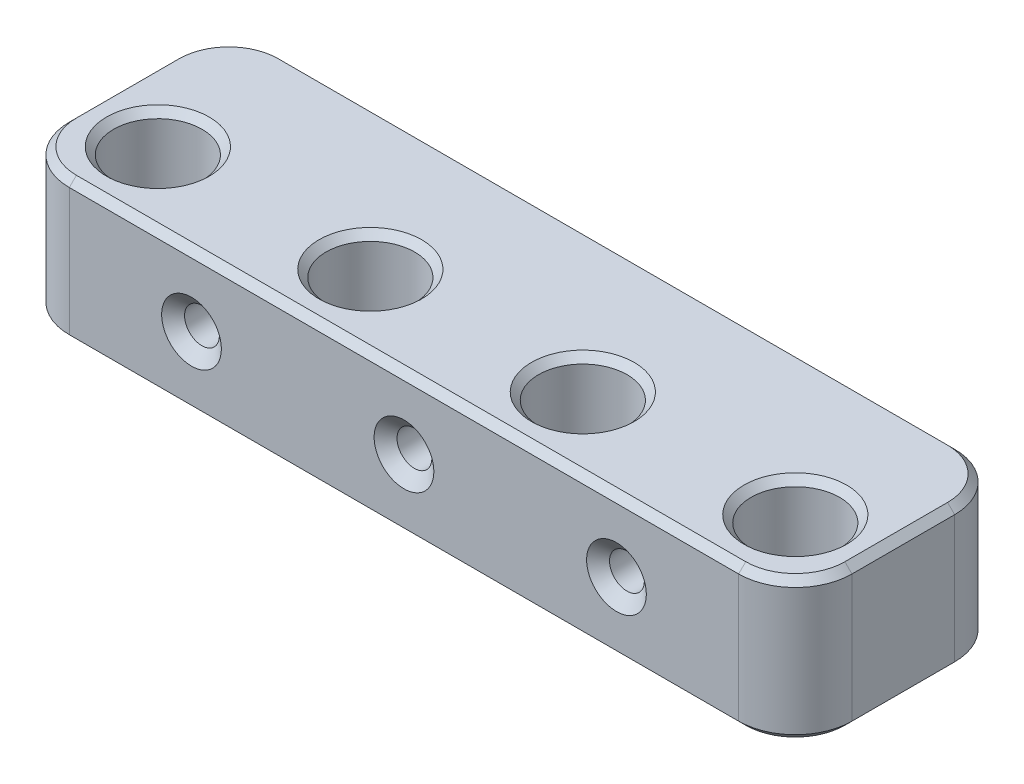
ISO-10303-21;
HEADER;
FILE_DESCRIPTION(('STEP AP214'),'2;1');
FILE_NAME('part.step','',(''),(''),'','','');
FILE_SCHEMA(('AUTOMOTIVE_DESIGN { 1 0 10303 214 1 1 1 1 }'));
ENDSEC;
DATA;
#1=APPLICATION_CONTEXT('core data for automotive mechanical design processes');
#2=APPLICATION_PROTOCOL_DEFINITION('international standard','automotive_design',2000,#1);
#3=PRODUCT_CONTEXT('',#1,'mechanical');
#4=PRODUCT('Part','Part','',(#3));
#5=PRODUCT_RELATED_PRODUCT_CATEGORY('part','',(#4));
#6=PRODUCT_DEFINITION_FORMATION('','',#4);
#7=PRODUCT_DEFINITION_CONTEXT('part definition',#1,'design');
#8=PRODUCT_DEFINITION('design','',#6,#7);
#9=PRODUCT_DEFINITION_SHAPE('','',#8);
#10=(LENGTH_UNIT() NAMED_UNIT(*) SI_UNIT(.MILLI.,.METRE.));
#11=(NAMED_UNIT(*) PLANE_ANGLE_UNIT() SI_UNIT($,.RADIAN.));
#12=(NAMED_UNIT(*) SI_UNIT($,.STERADIAN.) SOLID_ANGLE_UNIT());
#13=UNCERTAINTY_MEASURE_WITH_UNIT(LENGTH_MEASURE(1.E-05),#10,'distance_accuracy_value','');
#14=(GEOMETRIC_REPRESENTATION_CONTEXT(3) GLOBAL_UNCERTAINTY_ASSIGNED_CONTEXT((#13)) GLOBAL_UNIT_ASSIGNED_CONTEXT((#10,
#11,#12)) REPRESENTATION_CONTEXT('',''));
#15=CARTESIAN_POINT('',(0.,0.,0.));
#16=DIRECTION('',(0.,0.,1.));
#17=DIRECTION('',(1.,0.,0.));
#18=AXIS2_PLACEMENT_3D('',#15,#16,#17);
#19=CARTESIAN_POINT('',(-10.25,20.,10.25));
#20=DIRECTION('',(0.,0.,-1.));
#21=DIRECTION('',(-1.,0.,0.));
#22=AXIS2_PLACEMENT_3D('',#19,#20,#21);
#23=PLANE('',#22);
#24=CARTESIAN_POINT('',(15.,10.,10.25));
#25=DIRECTION('',(0.,0.,1.));
#26=DIRECTION('',(1.,0.,0.));
#27=AXIS2_PLACEMENT_3D('',#24,#25,#26);
#28=CIRCLE('',#27,4.2164);
#29=CARTESIAN_POINT('',(19.2164,10.,10.25));
#30=VERTEX_POINT('',#29);
#31=EDGE_CURVE('E292',#30,#30,#28,.T.);
#32=ORIENTED_EDGE('',*,*,#31,.F.);
#33=EDGE_LOOP('',(#32));
#34=FACE_BOUND('',#33,.T.);
#35=CARTESIAN_POINT('',(75.,10.,10.25));
#36=DIRECTION('',(0.,0.,1.));
#37=DIRECTION('',(1.,0.,0.));
#38=AXIS2_PLACEMENT_3D('',#35,#36,#37);
#39=CIRCLE('',#38,4.21639999999999);
#40=CARTESIAN_POINT('',(79.2164,10.,10.25));
#41=VERTEX_POINT('',#40);
#42=EDGE_CURVE('E415',#41,#41,#39,.T.);
#43=ORIENTED_EDGE('',*,*,#42,.F.);
#44=EDGE_LOOP('',(#43));
#45=FACE_BOUND('',#44,.T.);
#46=DIRECTION('',(0.,-1.,0.));
#47=VECTOR('',#46,1.);
#48=CARTESIAN_POINT('',(-2.25,20.,10.25));
#49=LINE('',#48,#47);
#50=CARTESIAN_POINT('',(-2.25,19.,10.25));
#51=VERTEX_POINT('',#50);
#52=CARTESIAN_POINT('',(-2.25,1.,10.25));
#53=VERTEX_POINT('',#52);
#54=EDGE_CURVE('E331',#51,#53,#49,.T.);
#55=ORIENTED_EDGE('',*,*,#54,.T.);
#56=DIRECTION('',(1.,0.,0.));
#57=VECTOR('',#56,1.);
#58=CARTESIAN_POINT('',(92.25,1.,10.25));
#59=LINE('',#58,#57);
#60=CARTESIAN_POINT('',(92.25,1.,10.25));
#61=VERTEX_POINT('',#60);
#62=EDGE_CURVE('E226',#53,#61,#59,.T.);
#63=ORIENTED_EDGE('',*,*,#62,.T.);
#64=DIRECTION('',(0.,-1.,0.));
#65=VECTOR('',#64,1.);
#66=CARTESIAN_POINT('',(92.25,20.,10.25));
#67=LINE('',#66,#65);
#68=CARTESIAN_POINT('',(92.25,19.,10.25));
#69=VERTEX_POINT('',#68);
#70=EDGE_CURVE('E174',#61,#69,#67,.F.);
#71=ORIENTED_EDGE('',*,*,#70,.T.);
#72=DIRECTION('',(-1.,0.,0.));
#73=VECTOR('',#72,1.);
#74=CARTESIAN_POINT('',(-10.25,19.,10.25));
#75=LINE('',#74,#73);
#76=EDGE_CURVE('E224',#69,#51,#75,.T.);
#77=ORIENTED_EDGE('',*,*,#76,.T.);
#78=EDGE_LOOP('',(#55,#63,#71,#77));
#79=FACE_BOUND('',#78,.T.);
#80=CARTESIAN_POINT('',(45.,10.,10.25));
#81=DIRECTION('',(0.,0.,1.));
#82=DIRECTION('',(1.,0.,0.));
#83=AXIS2_PLACEMENT_3D('',#80,#81,#82);
#84=CIRCLE('',#83,4.2164);
#85=CARTESIAN_POINT('',(49.2164,10.,10.25));
#86=VERTEX_POINT('',#85);
#87=EDGE_CURVE('E424',#86,#86,#84,.T.);
#88=ORIENTED_EDGE('',*,*,#87,.F.);
#89=EDGE_LOOP('',(#88));
#90=FACE_BOUND('',#89,.T.);
#91=ADVANCED_FACE('F38',(#34,#45,#79,#90),#23,.F.);
#92=CARTESIAN_POINT('',(0.,20.,0.));
#93=DIRECTION('',(0.,-1.,0.));
#94=DIRECTION('',(0.,0.,-1.));
#95=AXIS2_PLACEMENT_3D('',#92,#93,#94);
#96=PLANE('',#95);
#97=CARTESIAN_POINT('',(90.,20.,0.));
#98=DIRECTION('',(0.,-1.,0.));
#99=DIRECTION('',(0.,0.,-1.));
#100=AXIS2_PLACEMENT_3D('',#97,#98,#99);
#101=CIRCLE('',#100,7.25000000000002);
#102=CARTESIAN_POINT('',(90.,20.,-7.25000000000002));
#103=VERTEX_POINT('',#102);
#104=EDGE_CURVE('E11',#103,#103,#101,.T.);
#105=ORIENTED_EDGE('',*,*,#104,.T.);
#106=EDGE_LOOP('',(#105));
#107=FACE_BOUND('',#106,.T.);
#108=CARTESIAN_POINT('',(60.,20.,0.));
#109=DIRECTION('',(0.,-1.,0.));
#110=DIRECTION('',(0.,0.,-1.));
#111=AXIS2_PLACEMENT_3D('',#108,#109,#110);
#112=CIRCLE('',#111,7.25000000000002);
#113=CARTESIAN_POINT('',(60.,20.,-7.25000000000002));
#114=VERTEX_POINT('',#113);
#115=EDGE_CURVE('E48',#114,#114,#112,.T.);
#116=ORIENTED_EDGE('',*,*,#115,.T.);
#117=EDGE_LOOP('',(#116));
#118=FACE_BOUND('',#117,.T.);
#119=CARTESIAN_POINT('',(30.,20.,0.));
#120=DIRECTION('',(0.,-1.,0.));
#121=DIRECTION('',(0.,0.,-1.));
#122=AXIS2_PLACEMENT_3D('',#119,#120,#121);
#123=CIRCLE('',#122,7.25000000000002);
#124=CARTESIAN_POINT('',(30.,20.,-7.25000000000002));
#125=VERTEX_POINT('',#124);
#126=EDGE_CURVE('E270',#125,#125,#123,.T.);
#127=ORIENTED_EDGE('',*,*,#126,.T.);
#128=EDGE_LOOP('',(#127));
#129=FACE_BOUND('',#128,.T.);
#130=CARTESIAN_POINT('',(0.,20.,0.));
#131=DIRECTION('',(0.,-1.,0.));
#132=DIRECTION('',(0.,0.,-1.));
#133=AXIS2_PLACEMENT_3D('',#130,#131,#132);
#134=CIRCLE('',#133,7.25000000000002);
#135=CARTESIAN_POINT('',(0.,20.,-7.25000000000002));
#136=VERTEX_POINT('',#135);
#137=EDGE_CURVE('E267',#136,#136,#134,.T.);
#138=ORIENTED_EDGE('',*,*,#137,.T.);
#139=EDGE_LOOP('',(#138));
#140=FACE_BOUND('',#139,.T.);
#141=DIRECTION('',(0.,0.,-1.));
#142=VECTOR('',#141,1.);
#143=CARTESIAN_POINT('',(99.25,20.,0.));
#144=LINE('',#143,#142);
#145=CARTESIAN_POINT('',(99.25,20.,2.25));
#146=VERTEX_POINT('',#145);
#147=CARTESIAN_POINT('',(99.25,20.,-12.25));
#148=VERTEX_POINT('',#147);
#149=EDGE_CURVE('E56',#146,#148,#144,.T.);
#150=ORIENTED_EDGE('',*,*,#149,.T.);
#151=CARTESIAN_POINT('',(92.25,20.,-12.25));
#152=DIRECTION('',(0.,-1.,0.));
#153=DIRECTION('',(0.,0.,-1.));
#154=AXIS2_PLACEMENT_3D('',#151,#152,#153);
#155=CIRCLE('',#154,7.);
#156=CARTESIAN_POINT('',(92.25,20.,-19.25));
#157=VERTEX_POINT('',#156);
#158=EDGE_CURVE('E265',#148,#157,#155,.F.);
#159=ORIENTED_EDGE('',*,*,#158,.T.);
#160=DIRECTION('',(-1.,0.,0.));
#161=VECTOR('',#160,1.);
#162=CARTESIAN_POINT('',(-2.25,20.,-19.25));
#163=LINE('',#162,#161);
#164=CARTESIAN_POINT('',(-2.25,20.,-19.25));
#165=VERTEX_POINT('',#164);
#166=EDGE_CURVE('E253',#157,#165,#163,.T.);
#167=ORIENTED_EDGE('',*,*,#166,.T.);
#168=CARTESIAN_POINT('',(-2.25,20.,-12.25));
#169=DIRECTION('',(0.,-1.,0.));
#170=DIRECTION('',(0.,0.,-1.));
#171=AXIS2_PLACEMENT_3D('',#168,#169,#170);
#172=CIRCLE('',#171,7.);
#173=CARTESIAN_POINT('',(-9.25,20.,-12.25));
#174=VERTEX_POINT('',#173);
#175=EDGE_CURVE('E255',#165,#174,#172,.F.);
#176=ORIENTED_EDGE('',*,*,#175,.T.);
#177=DIRECTION('',(0.,0.,1.));
#178=VECTOR('',#177,1.);
#179=CARTESIAN_POINT('',(-9.25,20.,0.));
#180=LINE('',#179,#178);
#181=CARTESIAN_POINT('',(-9.25,20.,2.25));
#182=VERTEX_POINT('',#181);
#183=EDGE_CURVE('E257',#174,#182,#180,.T.);
#184=ORIENTED_EDGE('',*,*,#183,.T.);
#185=CARTESIAN_POINT('',(-2.25,20.,2.25));
#186=DIRECTION('',(0.,-1.,0.));
#187=DIRECTION('',(0.,0.,-1.));
#188=AXIS2_PLACEMENT_3D('',#185,#186,#187);
#189=CIRCLE('',#188,7.);
#190=CARTESIAN_POINT('',(-2.25,20.,9.25));
#191=VERTEX_POINT('',#190);
#192=EDGE_CURVE('E259',#182,#191,#189,.F.);
#193=ORIENTED_EDGE('',*,*,#192,.T.);
#194=DIRECTION('',(1.,0.,0.));
#195=VECTOR('',#194,1.);
#196=CARTESIAN_POINT('',(0.,20.,9.25));
#197=LINE('',#196,#195);
#198=CARTESIAN_POINT('',(92.25,20.,9.25));
#199=VERTEX_POINT('',#198);
#200=EDGE_CURVE('E261',#191,#199,#197,.T.);
#201=ORIENTED_EDGE('',*,*,#200,.T.);
#202=CARTESIAN_POINT('',(92.25,20.,2.25));
#203=DIRECTION('',(0.,-1.,0.));
#204=DIRECTION('',(0.,0.,-1.));
#205=AXIS2_PLACEMENT_3D('',#202,#203,#204);
#206=CIRCLE('',#205,6.99999999999999);
#207=EDGE_CURVE('E61',#199,#146,#206,.F.);
#208=ORIENTED_EDGE('',*,*,#207,.T.);
#209=EDGE_LOOP('',(#150,#159,#167,#176,#184,#193,#201,#208));
#210=FACE_BOUND('',#209,.T.);
#211=ADVANCED_FACE('F388',(#107,#118,#129,#140,#210),#96,.F.);
#212=CARTESIAN_POINT('',(0.,0.,0.));
#213=DIRECTION('',(0.,-1.,0.));
#214=DIRECTION('',(0.,0.,-1.));
#215=AXIS2_PLACEMENT_3D('',#212,#213,#214);
#216=PLANE('',#215);
#217=CARTESIAN_POINT('',(90.,0.,0.));
#218=DIRECTION('',(0.,-1.,0.));
#219=DIRECTION('',(0.,0.,-1.));
#220=AXIS2_PLACEMENT_3D('',#217,#218,#219);
#221=CIRCLE('',#220,7.25000000000002);
#222=CARTESIAN_POINT('',(90.,0.,-7.25000000000002));
#223=VERTEX_POINT('',#222);
#224=EDGE_CURVE('E194',#223,#223,#221,.F.);
#225=ORIENTED_EDGE('',*,*,#224,.T.);
#226=EDGE_LOOP('',(#225));
#227=FACE_BOUND('',#226,.T.);
#228=CARTESIAN_POINT('',(60.,0.,0.));
#229=DIRECTION('',(0.,-1.,0.));
#230=DIRECTION('',(0.,0.,-1.));
#231=AXIS2_PLACEMENT_3D('',#228,#229,#230);
#232=CIRCLE('',#231,7.25000000000002);
#233=CARTESIAN_POINT('',(60.,0.,-7.25000000000002));
#234=VERTEX_POINT('',#233);
#235=EDGE_CURVE('E191',#234,#234,#232,.F.);
#236=ORIENTED_EDGE('',*,*,#235,.T.);
#237=EDGE_LOOP('',(#236));
#238=FACE_BOUND('',#237,.T.);
#239=CARTESIAN_POINT('',(30.,0.,0.));
#240=DIRECTION('',(0.,-1.,0.));
#241=DIRECTION('',(0.,0.,-1.));
#242=AXIS2_PLACEMENT_3D('',#239,#240,#241);
#243=CIRCLE('',#242,7.25000000000002);
#244=CARTESIAN_POINT('',(30.,0.,-7.25000000000002));
#245=VERTEX_POINT('',#244);
#246=EDGE_CURVE('E183',#245,#245,#243,.F.);
#247=ORIENTED_EDGE('',*,*,#246,.T.);
#248=EDGE_LOOP('',(#247));
#249=FACE_BOUND('',#248,.T.);
#250=CARTESIAN_POINT('',(0.,0.,0.));
#251=DIRECTION('',(0.,-1.,0.));
#252=DIRECTION('',(0.,0.,-1.));
#253=AXIS2_PLACEMENT_3D('',#250,#251,#252);
#254=CIRCLE('',#253,7.25000000000002);
#255=CARTESIAN_POINT('',(0.,0.,-7.25000000000002));
#256=VERTEX_POINT('',#255);
#257=EDGE_CURVE('E180',#256,#256,#254,.F.);
#258=ORIENTED_EDGE('',*,*,#257,.T.);
#259=EDGE_LOOP('',(#258));
#260=FACE_BOUND('',#259,.T.);
#261=DIRECTION('',(-1.,0.,0.));
#262=VECTOR('',#261,1.);
#263=CARTESIAN_POINT('',(-2.25,0.,9.25));
#264=LINE('',#263,#262);
#265=CARTESIAN_POINT('',(92.25,0.,9.25000000000001));
#266=VERTEX_POINT('',#265);
#267=CARTESIAN_POINT('',(-2.25,0.,9.25));
#268=VERTEX_POINT('',#267);
#269=EDGE_CURVE('E178',#266,#268,#264,.T.);
#270=ORIENTED_EDGE('',*,*,#269,.T.);
#271=CARTESIAN_POINT('',(-2.25,0.,2.25));
#272=DIRECTION('',(0.,-1.,0.));
#273=DIRECTION('',(0.,0.,-1.));
#274=AXIS2_PLACEMENT_3D('',#271,#272,#273);
#275=CIRCLE('',#274,7.);
#276=CARTESIAN_POINT('',(-9.25,0.,2.25));
#277=VERTEX_POINT('',#276);
#278=EDGE_CURVE('E159',#268,#277,#275,.T.);
#279=ORIENTED_EDGE('',*,*,#278,.T.);
#280=DIRECTION('',(0.,0.,-1.));
#281=VECTOR('',#280,1.);
#282=CARTESIAN_POINT('',(-9.25,0.,-12.25));
#283=LINE('',#282,#281);
#284=CARTESIAN_POINT('',(-9.25,0.,-12.25));
#285=VERTEX_POINT('',#284);
#286=EDGE_CURVE('E167',#277,#285,#283,.T.);
#287=ORIENTED_EDGE('',*,*,#286,.T.);
#288=CARTESIAN_POINT('',(-2.25,0.,-12.25));
#289=DIRECTION('',(0.,-1.,0.));
#290=DIRECTION('',(0.,0.,-1.));
#291=AXIS2_PLACEMENT_3D('',#288,#289,#290);
#292=CIRCLE('',#291,7.);
#293=CARTESIAN_POINT('',(-2.25,0.,-19.25));
#294=VERTEX_POINT('',#293);
#295=EDGE_CURVE('E173',#285,#294,#292,.T.);
#296=ORIENTED_EDGE('',*,*,#295,.T.);
#297=DIRECTION('',(1.,0.,0.));
#298=VECTOR('',#297,1.);
#299=CARTESIAN_POINT('',(0.,0.,-19.25));
#300=LINE('',#299,#298);
#301=CARTESIAN_POINT('',(92.25,0.,-19.25));
#302=VERTEX_POINT('',#301);
#303=EDGE_CURVE('E355',#294,#302,#300,.T.);
#304=ORIENTED_EDGE('',*,*,#303,.T.);
#305=CARTESIAN_POINT('',(92.25,0.,-12.25));
#306=DIRECTION('',(0.,-1.,0.));
#307=DIRECTION('',(0.,0.,-1.));
#308=AXIS2_PLACEMENT_3D('',#305,#306,#307);
#309=CIRCLE('',#308,6.99999999999999);
#310=CARTESIAN_POINT('',(99.25,0.,-12.25));
#311=VERTEX_POINT('',#310);
#312=EDGE_CURVE('E357',#302,#311,#309,.T.);
#313=ORIENTED_EDGE('',*,*,#312,.T.);
#314=DIRECTION('',(0.,0.,1.));
#315=VECTOR('',#314,1.);
#316=CARTESIAN_POINT('',(99.25,0.,2.25));
#317=LINE('',#316,#315);
#318=CARTESIAN_POINT('',(99.25,0.,2.25));
#319=VERTEX_POINT('',#318);
#320=EDGE_CURVE('E359',#311,#319,#317,.T.);
#321=ORIENTED_EDGE('',*,*,#320,.T.);
#322=CARTESIAN_POINT('',(92.25,0.,2.25));
#323=DIRECTION('',(0.,-1.,0.));
#324=DIRECTION('',(0.,0.,-1.));
#325=AXIS2_PLACEMENT_3D('',#322,#323,#324);
#326=CIRCLE('',#325,7.00000000000001);
#327=EDGE_CURVE('E185',#319,#266,#326,.T.);
#328=ORIENTED_EDGE('',*,*,#327,.T.);
#329=EDGE_LOOP('',(#270,#279,#287,#296,#304,#313,#321,#328));
#330=FACE_BOUND('',#329,.T.);
#331=ADVANCED_FACE('F176',(#227,#238,#249,#260,#330),#216,.T.);
#332=CARTESIAN_POINT('',(-10.25,20.,10.25));
#333=DIRECTION('',(1.,0.,0.));
#334=DIRECTION('',(0.,0.,-1.));
#335=AXIS2_PLACEMENT_3D('',#332,#333,#334);
#336=PLANE('',#335);
#337=DIRECTION('',(0.,1.,0.));
#338=VECTOR('',#337,1.);
#339=CARTESIAN_POINT('',(-10.25,0.,-12.25));
#340=LINE('',#339,#338);
#341=CARTESIAN_POINT('',(-10.25,19.,-12.25));
#342=VERTEX_POINT('',#341);
#343=CARTESIAN_POINT('',(-10.25,1.,-12.25));
#344=VERTEX_POINT('',#343);
#345=EDGE_CURVE('E336',#342,#344,#340,.F.);
#346=ORIENTED_EDGE('',*,*,#345,.T.);
#347=DIRECTION('',(0.,0.,1.));
#348=VECTOR('',#347,1.);
#349=CARTESIAN_POINT('',(-10.25,1.,2.25));
#350=LINE('',#349,#348);
#351=CARTESIAN_POINT('',(-10.25,1.,2.25));
#352=VERTEX_POINT('',#351);
#353=EDGE_CURVE('E251',#344,#352,#350,.T.);
#354=ORIENTED_EDGE('',*,*,#353,.T.);
#355=DIRECTION('',(0.,-1.,0.));
#356=VECTOR('',#355,1.);
#357=CARTESIAN_POINT('',(-10.25,20.,2.25));
#358=LINE('',#357,#356);
#359=CARTESIAN_POINT('',(-10.25,19.,2.25));
#360=VERTEX_POINT('',#359);
#361=EDGE_CURVE('E329',#352,#360,#358,.F.);
#362=ORIENTED_EDGE('',*,*,#361,.T.);
#363=DIRECTION('',(0.,0.,-1.));
#364=VECTOR('',#363,1.);
#365=CARTESIAN_POINT('',(-10.25,19.,10.25));
#366=LINE('',#365,#364);
#367=EDGE_CURVE('E249',#360,#342,#366,.T.);
#368=ORIENTED_EDGE('',*,*,#367,.T.);
#369=EDGE_LOOP('',(#346,#354,#362,#368));
#370=FACE_BOUND('',#369,.T.);
#371=ADVANCED_FACE('F334',(#370),#336,.F.);
#372=CARTESIAN_POINT('',(0.,20.,0.));
#373=DIRECTION('',(0.,-1.,0.));
#374=DIRECTION('',(0.,0.,-1.));
#375=AXIS2_PLACEMENT_3D('',#372,#373,#374);
#376=CYLINDRICAL_SURFACE('',#375,6.25);
#377=CARTESIAN_POINT('',(0.,1.00000000000003,0.));
#378=DIRECTION('',(0.,-1.,0.));
#379=DIRECTION('',(0.,0.,-1.));
#380=AXIS2_PLACEMENT_3D('',#377,#378,#379);
#381=CIRCLE('',#380,6.25);
#382=CARTESIAN_POINT('',(0.,1.00000000000003,-6.25));
#383=VERTEX_POINT('',#382);
#384=EDGE_CURVE('E218',#383,#383,#381,.T.);
#385=ORIENTED_EDGE('',*,*,#384,.T.);
#386=EDGE_LOOP('',(#385));
#387=FACE_BOUND('',#386,.T.);
#388=CARTESIAN_POINT('',(0.,19.,0.));
#389=DIRECTION('',(0.,-1.,0.));
#390=DIRECTION('',(0.,0.,-1.));
#391=AXIS2_PLACEMENT_3D('',#388,#389,#390);
#392=CIRCLE('',#391,6.25);
#393=CARTESIAN_POINT('',(0.,19.,-6.25));
#394=VERTEX_POINT('',#393);
#395=EDGE_CURVE('E215',#394,#394,#392,.F.);
#396=ORIENTED_EDGE('',*,*,#395,.T.);
#397=EDGE_LOOP('',(#396));
#398=FACE_BOUND('',#397,.T.);
#399=ADVANCED_FACE('F479',(#387,#398),#376,.F.);
#400=CARTESIAN_POINT('',(0.,0.,-20.25));
#401=DIRECTION('',(0.,0.,-1.));
#402=DIRECTION('',(-1.,0.,0.));
#403=AXIS2_PLACEMENT_3D('',#400,#401,#402);
#404=PLANE('',#403);
#405=CARTESIAN_POINT('',(15.,10.,-20.25));
#406=DIRECTION('',(0.,0.,1.));
#407=DIRECTION('',(1.,0.,0.));
#408=AXIS2_PLACEMENT_3D('',#405,#406,#407);
#409=CIRCLE('',#408,2.45745);
#410=CARTESIAN_POINT('',(17.45745,10.,-20.25));
#411=VERTEX_POINT('',#410);
#412=EDGE_CURVE('E427',#411,#411,#409,.T.);
#413=ORIENTED_EDGE('',*,*,#412,.T.);
#414=EDGE_LOOP('',(#413));
#415=FACE_BOUND('',#414,.T.);
#416=CARTESIAN_POINT('',(45.,10.,-20.25));
#417=DIRECTION('',(0.,0.,1.));
#418=DIRECTION('',(1.,0.,0.));
#419=AXIS2_PLACEMENT_3D('',#416,#417,#418);
#420=CIRCLE('',#419,2.45744999999999);
#421=CARTESIAN_POINT('',(47.45745,10.,-20.25));
#422=VERTEX_POINT('',#421);
#423=EDGE_CURVE('E418',#422,#422,#420,.T.);
#424=ORIENTED_EDGE('',*,*,#423,.T.);
#425=EDGE_LOOP('',(#424));
#426=FACE_BOUND('',#425,.T.);
#427=CARTESIAN_POINT('',(75.,10.,-20.25));
#428=DIRECTION('',(0.,0.,1.));
#429=DIRECTION('',(1.,0.,0.));
#430=AXIS2_PLACEMENT_3D('',#427,#428,#429);
#431=CIRCLE('',#430,2.45745);
#432=CARTESIAN_POINT('',(77.45745,10.,-20.25));
#433=VERTEX_POINT('',#432);
#434=EDGE_CURVE('E408',#433,#433,#431,.T.);
#435=ORIENTED_EDGE('',*,*,#434,.T.);
#436=EDGE_LOOP('',(#435));
#437=FACE_BOUND('',#436,.T.);
#438=DIRECTION('',(0.,-1.,0.));
#439=VECTOR('',#438,1.);
#440=CARTESIAN_POINT('',(92.25,0.,-20.25));
#441=LINE('',#440,#439);
#442=CARTESIAN_POINT('',(92.25,19.,-20.25));
#443=VERTEX_POINT('',#442);
#444=CARTESIAN_POINT('',(92.25,1.,-20.25));
#445=VERTEX_POINT('',#444);
#446=EDGE_CURVE('E342',#443,#445,#441,.T.);
#447=ORIENTED_EDGE('',*,*,#446,.T.);
#448=DIRECTION('',(-1.,0.,0.));
#449=VECTOR('',#448,1.);
#450=CARTESIAN_POINT('',(0.,1.,-20.25));
#451=LINE('',#450,#449);
#452=CARTESIAN_POINT('',(-2.25,1.,-20.25));
#453=VERTEX_POINT('',#452);
#454=EDGE_CURVE('E243',#445,#453,#451,.T.);
#455=ORIENTED_EDGE('',*,*,#454,.T.);
#456=DIRECTION('',(0.,1.,0.));
#457=VECTOR('',#456,1.);
#458=CARTESIAN_POINT('',(-2.25,20.,-20.25));
#459=LINE('',#458,#457);
#460=CARTESIAN_POINT('',(-2.25,19.,-20.25));
#461=VERTEX_POINT('',#460);
#462=EDGE_CURVE('E337',#453,#461,#459,.T.);
#463=ORIENTED_EDGE('',*,*,#462,.T.);
#464=DIRECTION('',(1.,0.,0.));
#465=VECTOR('',#464,1.);
#466=CARTESIAN_POINT('',(92.25,19.,-20.25));
#467=LINE('',#466,#465);
#468=EDGE_CURVE('E241',#461,#443,#467,.T.);
#469=ORIENTED_EDGE('',*,*,#468,.T.);
#470=EDGE_LOOP('',(#447,#455,#463,#469));
#471=FACE_BOUND('',#470,.T.);
#472=ADVANCED_FACE('F401',(#415,#426,#437,#471),#404,.T.);
#473=CARTESIAN_POINT('',(30.,20.,0.));
#474=DIRECTION('',(0.,-1.,0.));
#475=DIRECTION('',(0.,0.,-1.));
#476=AXIS2_PLACEMENT_3D('',#473,#474,#475);
#477=CYLINDRICAL_SURFACE('',#476,6.25);
#478=CARTESIAN_POINT('',(30.,1.00000000000003,0.));
#479=DIRECTION('',(0.,-1.,0.));
#480=DIRECTION('',(0.,0.,-1.));
#481=AXIS2_PLACEMENT_3D('',#478,#479,#480);
#482=CIRCLE('',#481,6.25);
#483=CARTESIAN_POINT('',(30.,1.00000000000003,-6.25));
#484=VERTEX_POINT('',#483);
#485=EDGE_CURVE('E212',#484,#484,#482,.T.);
#486=ORIENTED_EDGE('',*,*,#485,.T.);
#487=EDGE_LOOP('',(#486));
#488=FACE_BOUND('',#487,.T.);
#489=CARTESIAN_POINT('',(30.,19.,0.));
#490=DIRECTION('',(0.,-1.,0.));
#491=DIRECTION('',(0.,0.,-1.));
#492=AXIS2_PLACEMENT_3D('',#489,#490,#491);
#493=CIRCLE('',#492,6.25);
#494=CARTESIAN_POINT('',(30.,19.,-6.25));
#495=VERTEX_POINT('',#494);
#496=EDGE_CURVE('E209',#495,#495,#493,.F.);
#497=ORIENTED_EDGE('',*,*,#496,.T.);
#498=EDGE_LOOP('',(#497));
#499=FACE_BOUND('',#498,.T.);
#500=ADVANCED_FACE('F472',(#488,#499),#477,.F.);
#501=CARTESIAN_POINT('',(60.,20.,0.));
#502=DIRECTION('',(0.,-1.,0.));
#503=DIRECTION('',(0.,0.,-1.));
#504=AXIS2_PLACEMENT_3D('',#501,#502,#503);
#505=CYLINDRICAL_SURFACE('',#504,6.25);
#506=CARTESIAN_POINT('',(60.,1.00000000000003,0.));
#507=DIRECTION('',(0.,-1.,0.));
#508=DIRECTION('',(0.,0.,-1.));
#509=AXIS2_PLACEMENT_3D('',#506,#507,#508);
#510=CIRCLE('',#509,6.25);
#511=CARTESIAN_POINT('',(60.,1.00000000000003,-6.25));
#512=VERTEX_POINT('',#511);
#513=EDGE_CURVE('E206',#512,#512,#510,.T.);
#514=ORIENTED_EDGE('',*,*,#513,.T.);
#515=EDGE_LOOP('',(#514));
#516=FACE_BOUND('',#515,.T.);
#517=CARTESIAN_POINT('',(60.,19.,0.));
#518=DIRECTION('',(0.,-1.,0.));
#519=DIRECTION('',(0.,0.,-1.));
#520=AXIS2_PLACEMENT_3D('',#517,#518,#519);
#521=CIRCLE('',#520,6.25);
#522=CARTESIAN_POINT('',(60.,19.,-6.25));
#523=VERTEX_POINT('',#522);
#524=EDGE_CURVE('E203',#523,#523,#521,.F.);
#525=ORIENTED_EDGE('',*,*,#524,.T.);
#526=EDGE_LOOP('',(#525));
#527=FACE_BOUND('',#526,.T.);
#528=ADVANCED_FACE('F468',(#516,#527),#505,.F.);
#529=CARTESIAN_POINT('',(100.25,20.,10.25));
#530=DIRECTION('',(-1.,0.,0.));
#531=DIRECTION('',(0.,0.,1.));
#532=AXIS2_PLACEMENT_3D('',#529,#530,#531);
#533=PLANE('',#532);
#534=DIRECTION('',(0.,-1.,0.));
#535=VECTOR('',#534,1.);
#536=CARTESIAN_POINT('',(100.25,20.,2.25));
#537=LINE('',#536,#535);
#538=CARTESIAN_POINT('',(100.25,19.,2.25));
#539=VERTEX_POINT('',#538);
#540=CARTESIAN_POINT('',(100.25,1.,2.25));
#541=VERTEX_POINT('',#540);
#542=EDGE_CURVE('E339',#539,#541,#537,.T.);
#543=ORIENTED_EDGE('',*,*,#542,.T.);
#544=DIRECTION('',(0.,0.,-1.));
#545=VECTOR('',#544,1.);
#546=CARTESIAN_POINT('',(100.25,1.,-12.25));
#547=LINE('',#546,#545);
#548=CARTESIAN_POINT('',(100.25,1.,-12.25));
#549=VERTEX_POINT('',#548);
#550=EDGE_CURVE('E234',#541,#549,#547,.T.);
#551=ORIENTED_EDGE('',*,*,#550,.T.);
#552=DIRECTION('',(0.,-1.,0.));
#553=VECTOR('',#552,1.);
#554=CARTESIAN_POINT('',(100.25,20.,-12.25));
#555=LINE('',#554,#553);
#556=CARTESIAN_POINT('',(100.25,19.,-12.25));
#557=VERTEX_POINT('',#556);
#558=EDGE_CURVE('E348',#549,#557,#555,.F.);
#559=ORIENTED_EDGE('',*,*,#558,.T.);
#560=DIRECTION('',(0.,0.,1.));
#561=VECTOR('',#560,1.);
#562=CARTESIAN_POINT('',(100.25,19.,10.25));
#563=LINE('',#562,#561);
#564=EDGE_CURVE('E232',#557,#539,#563,.T.);
#565=ORIENTED_EDGE('',*,*,#564,.T.);
#566=EDGE_LOOP('',(#543,#551,#559,#565));
#567=FACE_BOUND('',#566,.T.);
#568=ADVANCED_FACE('F464',(#567),#533,.F.);
#569=CARTESIAN_POINT('',(90.,20.,0.));
#570=DIRECTION('',(0.,-1.,0.));
#571=DIRECTION('',(0.,0.,-1.));
#572=AXIS2_PLACEMENT_3D('',#569,#570,#571);
#573=CYLINDRICAL_SURFACE('',#572,6.25);
#574=CARTESIAN_POINT('',(90.,1.00000000000003,0.));
#575=DIRECTION('',(0.,-1.,0.));
#576=DIRECTION('',(0.,0.,-1.));
#577=AXIS2_PLACEMENT_3D('',#574,#575,#576);
#578=CIRCLE('',#577,6.25);
#579=CARTESIAN_POINT('',(90.,1.00000000000003,-6.25));
#580=VERTEX_POINT('',#579);
#581=EDGE_CURVE('E200',#580,#580,#578,.T.);
#582=ORIENTED_EDGE('',*,*,#581,.T.);
#583=EDGE_LOOP('',(#582));
#584=FACE_BOUND('',#583,.T.);
#585=CARTESIAN_POINT('',(90.,19.,0.));
#586=DIRECTION('',(0.,-1.,0.));
#587=DIRECTION('',(0.,0.,-1.));
#588=AXIS2_PLACEMENT_3D('',#585,#586,#587);
#589=CIRCLE('',#588,6.25);
#590=CARTESIAN_POINT('',(90.,19.,-6.25));
#591=VERTEX_POINT('',#590);
#592=EDGE_CURVE('E197',#591,#591,#589,.F.);
#593=ORIENTED_EDGE('',*,*,#592,.T.);
#594=EDGE_LOOP('',(#593));
#595=FACE_BOUND('',#594,.T.);
#596=ADVANCED_FACE('F456',(#584,#595),#573,.F.);
#597=CARTESIAN_POINT('',(75.,10.,10.25));
#598=DIRECTION('',(0.,0.,1.));
#599=DIRECTION('',(1.,0.,0.));
#600=AXIS2_PLACEMENT_3D('',#597,#598,#599);
#601=CYLINDRICAL_SURFACE('',#600,2.45744999999999);
#602=ORIENTED_EDGE('',*,*,#434,.F.);
#603=EDGE_LOOP('',(#602));
#604=FACE_BOUND('',#603,.T.);
#605=CARTESIAN_POINT('',(75.,10.,8.77406570374072));
#606=DIRECTION('',(0.,0.,1.));
#607=DIRECTION('',(1.,0.,0.));
#608=AXIS2_PLACEMENT_3D('',#605,#606,#607);
#609=CIRCLE('',#608,2.45744999999999);
#610=CARTESIAN_POINT('',(77.45745,10.,8.77406570374072));
#611=VERTEX_POINT('',#610);
#612=EDGE_CURVE('E410',#611,#611,#609,.T.);
#613=ORIENTED_EDGE('',*,*,#612,.T.);
#614=EDGE_LOOP('',(#613));
#615=FACE_BOUND('',#614,.T.);
#616=ADVANCED_FACE('F446',(#604,#615),#601,.F.);
#617=CARTESIAN_POINT('',(75.,10.,10.25));
#618=DIRECTION('',(0.,0.,1.));
#619=DIRECTION('',(1.,0.,0.));
#620=AXIS2_PLACEMENT_3D('',#617,#618,#619);
#621=CONICAL_SURFACE('',#620,4.21639999999999,0.872664625997166);
#622=ORIENTED_EDGE('',*,*,#612,.F.);
#623=EDGE_LOOP('',(#622));
#624=FACE_BOUND('',#623,.T.);
#625=ORIENTED_EDGE('',*,*,#42,.T.);
#626=EDGE_LOOP('',(#625));
#627=FACE_BOUND('',#626,.T.);
#628=ADVANCED_FACE('F443',(#624,#627),#621,.F.);
#629=CARTESIAN_POINT('',(45.,10.,10.25));
#630=DIRECTION('',(0.,0.,1.));
#631=DIRECTION('',(1.,0.,0.));
#632=AXIS2_PLACEMENT_3D('',#629,#630,#631);
#633=CYLINDRICAL_SURFACE('',#632,2.45744999999999);
#634=ORIENTED_EDGE('',*,*,#423,.F.);
#635=EDGE_LOOP('',(#634));
#636=FACE_BOUND('',#635,.T.);
#637=CARTESIAN_POINT('',(45.,10.,8.77406570374072));
#638=DIRECTION('',(0.,0.,1.));
#639=DIRECTION('',(1.,0.,0.));
#640=AXIS2_PLACEMENT_3D('',#637,#638,#639);
#641=CIRCLE('',#640,2.45744999999999);
#642=CARTESIAN_POINT('',(47.45745,10.,8.77406570374072));
#643=VERTEX_POINT('',#642);
#644=EDGE_CURVE('E421',#643,#643,#641,.T.);
#645=ORIENTED_EDGE('',*,*,#644,.T.);
#646=EDGE_LOOP('',(#645));
#647=FACE_BOUND('',#646,.T.);
#648=ADVANCED_FACE('F445',(#636,#647),#633,.F.);
#649=CARTESIAN_POINT('',(45.,10.,10.25));
#650=DIRECTION('',(0.,0.,1.));
#651=DIRECTION('',(1.,0.,0.));
#652=AXIS2_PLACEMENT_3D('',#649,#650,#651);
#653=CONICAL_SURFACE('',#652,4.2164,0.872664625997168);
#654=ORIENTED_EDGE('',*,*,#644,.F.);
#655=EDGE_LOOP('',(#654));
#656=FACE_BOUND('',#655,.T.);
#657=ORIENTED_EDGE('',*,*,#87,.T.);
#658=EDGE_LOOP('',(#657));
#659=FACE_BOUND('',#658,.T.);
#660=ADVANCED_FACE('F453',(#656,#659),#653,.F.);
#661=CARTESIAN_POINT('',(15.,10.,10.25));
#662=DIRECTION('',(0.,0.,1.));
#663=DIRECTION('',(1.,0.,0.));
#664=AXIS2_PLACEMENT_3D('',#661,#662,#663);
#665=CYLINDRICAL_SURFACE('',#664,2.45744999999999);
#666=ORIENTED_EDGE('',*,*,#412,.F.);
#667=EDGE_LOOP('',(#666));
#668=FACE_BOUND('',#667,.T.);
#669=CARTESIAN_POINT('',(15.,10.,8.77406570374072));
#670=DIRECTION('',(0.,0.,1.));
#671=DIRECTION('',(1.,0.,0.));
#672=AXIS2_PLACEMENT_3D('',#669,#670,#671);
#673=CIRCLE('',#672,2.45744999999999);
#674=CARTESIAN_POINT('',(17.45745,10.,8.77406570374072));
#675=VERTEX_POINT('',#674);
#676=EDGE_CURVE('E430',#675,#675,#673,.T.);
#677=ORIENTED_EDGE('',*,*,#676,.T.);
#678=EDGE_LOOP('',(#677));
#679=FACE_BOUND('',#678,.T.);
#680=ADVANCED_FACE('F732',(#668,#679),#665,.F.);
#681=CARTESIAN_POINT('',(15.,10.,10.25));
#682=DIRECTION('',(0.,0.,1.));
#683=DIRECTION('',(1.,0.,0.));
#684=AXIS2_PLACEMENT_3D('',#681,#682,#683);
#685=CONICAL_SURFACE('',#684,4.2164,0.872664625997166);
#686=ORIENTED_EDGE('',*,*,#676,.F.);
#687=EDGE_LOOP('',(#686));
#688=FACE_BOUND('',#687,.T.);
#689=ORIENTED_EDGE('',*,*,#31,.T.);
#690=EDGE_LOOP('',(#689));
#691=FACE_BOUND('',#690,.T.);
#692=ADVANCED_FACE('F436',(#688,#691),#685,.F.);
#693=CARTESIAN_POINT('',(-2.25,0.,-12.25));
#694=DIRECTION('',(0.,-1.,0.));
#695=DIRECTION('',(0.,0.,-1.));
#696=AXIS2_PLACEMENT_3D('',#693,#694,#695);
#697=CYLINDRICAL_SURFACE('',#696,8.);
#698=ORIENTED_EDGE('',*,*,#462,.F.);
#699=CARTESIAN_POINT('',(-2.25,1.,-12.25));
#700=DIRECTION('',(0.,-1.,0.));
#701=DIRECTION('',(0.,0.,-1.));
#702=AXIS2_PLACEMENT_3D('',#699,#700,#701);
#703=CIRCLE('',#702,8.);
#704=EDGE_CURVE('E247',#453,#344,#703,.F.);
#705=ORIENTED_EDGE('',*,*,#704,.T.);
#706=ORIENTED_EDGE('',*,*,#345,.F.);
#707=CARTESIAN_POINT('',(-2.25,19.,-12.25));
#708=DIRECTION('',(0.,-1.,0.));
#709=DIRECTION('',(0.,0.,-1.));
#710=AXIS2_PLACEMENT_3D('',#707,#708,#709);
#711=CIRCLE('',#710,8.);
#712=EDGE_CURVE('E245',#342,#461,#711,.T.);
#713=ORIENTED_EDGE('',*,*,#712,.T.);
#714=EDGE_LOOP('',(#698,#705,#706,#713));
#715=FACE_BOUND('',#714,.T.);
#716=ADVANCED_FACE('F492',(#715),#697,.T.);
#717=CARTESIAN_POINT('',(92.25,0.,-12.25));
#718=DIRECTION('',(0.,1.,0.));
#719=DIRECTION('',(0.,0.,1.));
#720=AXIS2_PLACEMENT_3D('',#717,#718,#719);
#721=CYLINDRICAL_SURFACE('',#720,8.);
#722=ORIENTED_EDGE('',*,*,#558,.F.);
#723=CARTESIAN_POINT('',(92.25,1.,-12.25));
#724=DIRECTION('',(0.,-1.,0.));
#725=DIRECTION('',(0.,0.,-1.));
#726=AXIS2_PLACEMENT_3D('',#723,#724,#725);
#727=CIRCLE('',#726,8.);
#728=EDGE_CURVE('E239',#549,#445,#727,.F.);
#729=ORIENTED_EDGE('',*,*,#728,.T.);
#730=ORIENTED_EDGE('',*,*,#446,.F.);
#731=CARTESIAN_POINT('',(92.25,19.,-12.25));
#732=DIRECTION('',(0.,-1.,0.));
#733=DIRECTION('',(0.,0.,-1.));
#734=AXIS2_PLACEMENT_3D('',#731,#732,#733);
#735=CIRCLE('',#734,8.);
#736=EDGE_CURVE('E236',#443,#557,#735,.T.);
#737=ORIENTED_EDGE('',*,*,#736,.T.);
#738=EDGE_LOOP('',(#722,#729,#730,#737));
#739=FACE_BOUND('',#738,.T.);
#740=ADVANCED_FACE('F406',(#739),#721,.T.);
#741=CARTESIAN_POINT('',(92.25,20.,2.25));
#742=DIRECTION('',(0.,-1.,0.));
#743=DIRECTION('',(0.,0.,-1.));
#744=AXIS2_PLACEMENT_3D('',#741,#742,#743);
#745=CYLINDRICAL_SURFACE('',#744,8.);
#746=ORIENTED_EDGE('',*,*,#70,.F.);
#747=CARTESIAN_POINT('',(92.25,1.,2.25));
#748=DIRECTION('',(0.,-1.,0.));
#749=DIRECTION('',(0.,0.,-1.));
#750=AXIS2_PLACEMENT_3D('',#747,#748,#749);
#751=CIRCLE('',#750,8.);
#752=EDGE_CURVE('E230',#61,#541,#751,.F.);
#753=ORIENTED_EDGE('',*,*,#752,.T.);
#754=ORIENTED_EDGE('',*,*,#542,.F.);
#755=CARTESIAN_POINT('',(92.25,19.,2.25));
#756=DIRECTION('',(0.,-1.,0.));
#757=DIRECTION('',(0.,0.,-1.));
#758=AXIS2_PLACEMENT_3D('',#755,#756,#757);
#759=CIRCLE('',#758,8.);
#760=EDGE_CURVE('E228',#539,#69,#759,.T.);
#761=ORIENTED_EDGE('',*,*,#760,.T.);
#762=EDGE_LOOP('',(#746,#753,#754,#761));
#763=FACE_BOUND('',#762,.T.);
#764=ADVANCED_FACE('F374',(#763),#745,.T.);
#765=CARTESIAN_POINT('',(-2.25,20.,2.25));
#766=DIRECTION('',(0.,-1.,0.));
#767=DIRECTION('',(0.,0.,-1.));
#768=AXIS2_PLACEMENT_3D('',#765,#766,#767);
#769=CYLINDRICAL_SURFACE('',#768,8.);
#770=ORIENTED_EDGE('',*,*,#361,.F.);
#771=CARTESIAN_POINT('',(-2.25,1.,2.25));
#772=DIRECTION('',(0.,-1.,0.));
#773=DIRECTION('',(0.,0.,-1.));
#774=AXIS2_PLACEMENT_3D('',#771,#772,#773);
#775=CIRCLE('',#774,8.);
#776=EDGE_CURVE('E161',#352,#53,#775,.F.);
#777=ORIENTED_EDGE('',*,*,#776,.T.);
#778=ORIENTED_EDGE('',*,*,#54,.F.);
#779=CARTESIAN_POINT('',(-2.25,19.,2.25));
#780=DIRECTION('',(0.,-1.,0.));
#781=DIRECTION('',(0.,0.,-1.));
#782=AXIS2_PLACEMENT_3D('',#779,#780,#781);
#783=CIRCLE('',#782,8.);
#784=EDGE_CURVE('E221',#51,#360,#783,.T.);
#785=ORIENTED_EDGE('',*,*,#784,.T.);
#786=EDGE_LOOP('',(#770,#777,#778,#785));
#787=FACE_BOUND('',#786,.T.);
#788=ADVANCED_FACE('F328',(#787),#769,.T.);
#789=CARTESIAN_POINT('',(90.,0.,0.));
#790=DIRECTION('',(0.,-1.,0.));
#791=DIRECTION('',(0.,0.,-1.));
#792=AXIS2_PLACEMENT_3D('',#789,#790,#791);
#793=CONICAL_SURFACE('',#792,7.25000000000002,0.785398163397446);
#794=ORIENTED_EDGE('',*,*,#581,.F.);
#795=EDGE_LOOP('',(#794));
#796=FACE_BOUND('',#795,.T.);
#797=ORIENTED_EDGE('',*,*,#224,.F.);
#798=EDGE_LOOP('',(#797));
#799=FACE_BOUND('',#798,.T.);
#800=ADVANCED_FACE('F502',(#796,#799),#793,.F.);
#801=CARTESIAN_POINT('',(60.,0.,0.));
#802=DIRECTION('',(0.,-1.,0.));
#803=DIRECTION('',(0.,0.,-1.));
#804=AXIS2_PLACEMENT_3D('',#801,#802,#803);
#805=CONICAL_SURFACE('',#804,7.25000000000002,0.785398163397446);
#806=ORIENTED_EDGE('',*,*,#513,.F.);
#807=EDGE_LOOP('',(#806));
#808=FACE_BOUND('',#807,.T.);
#809=ORIENTED_EDGE('',*,*,#235,.F.);
#810=EDGE_LOOP('',(#809));
#811=FACE_BOUND('',#810,.T.);
#812=ADVANCED_FACE('F509',(#808,#811),#805,.F.);
#813=CARTESIAN_POINT('',(30.,0.,0.));
#814=DIRECTION('',(0.,-1.,0.));
#815=DIRECTION('',(0.,0.,-1.));
#816=AXIS2_PLACEMENT_3D('',#813,#814,#815);
#817=CONICAL_SURFACE('',#816,7.25000000000002,0.785398163397446);
#818=ORIENTED_EDGE('',*,*,#485,.F.);
#819=EDGE_LOOP('',(#818));
#820=FACE_BOUND('',#819,.T.);
#821=ORIENTED_EDGE('',*,*,#246,.F.);
#822=EDGE_LOOP('',(#821));
#823=FACE_BOUND('',#822,.T.);
#824=ADVANCED_FACE('F516',(#820,#823),#817,.F.);
#825=CARTESIAN_POINT('',(0.,0.,0.));
#826=DIRECTION('',(0.,-1.,0.));
#827=DIRECTION('',(0.,0.,-1.));
#828=AXIS2_PLACEMENT_3D('',#825,#826,#827);
#829=CONICAL_SURFACE('',#828,7.25000000000002,0.785398163397446);
#830=ORIENTED_EDGE('',*,*,#384,.F.);
#831=EDGE_LOOP('',(#830));
#832=FACE_BOUND('',#831,.T.);
#833=ORIENTED_EDGE('',*,*,#257,.F.);
#834=EDGE_LOOP('',(#833));
#835=FACE_BOUND('',#834,.T.);
#836=ADVANCED_FACE('F523',(#832,#835),#829,.F.);
#837=CARTESIAN_POINT('',(92.25,0.,-12.25));
#838=DIRECTION('',(0.,1.,0.));
#839=DIRECTION('',(0.,0.,1.));
#840=AXIS2_PLACEMENT_3D('',#837,#838,#839);
#841=CONICAL_SURFACE('',#840,7.,0.785398163397448);
#842=DIRECTION('',(0.,-0.707106781186545,0.70710678118655));
#843=VECTOR('',#842,1.);
#844=CARTESIAN_POINT('',(92.25,1.,-20.25));
#845=LINE('',#844,#843);
#846=EDGE_CURVE('E286',#445,#302,#845,.T.);
#847=ORIENTED_EDGE('',*,*,#846,.F.);
#848=ORIENTED_EDGE('',*,*,#728,.F.);
#849=DIRECTION('',(0.707106781186547,0.707106781186547,0.));
#850=VECTOR('',#849,1.);
#851=CARTESIAN_POINT('',(99.25,0.,-12.25));
#852=LINE('',#851,#850);
#853=EDGE_CURVE('E289',#311,#549,#852,.T.);
#854=ORIENTED_EDGE('',*,*,#853,.F.);
#855=ORIENTED_EDGE('',*,*,#312,.F.);
#856=EDGE_LOOP('',(#847,#848,#854,#855));
#857=FACE_BOUND('',#856,.T.);
#858=ADVANCED_FACE('F530',(#857),#841,.T.);
#859=CARTESIAN_POINT('',(100.25,1.,10.25));
#860=DIRECTION('',(0.707106781186547,-0.707106781186547,0.));
#861=DIRECTION('',(0.,0.,1.));
#862=AXIS2_PLACEMENT_3D('',#859,#860,#861);
#863=PLANE('',#862);
#864=ORIENTED_EDGE('',*,*,#853,.T.);
#865=ORIENTED_EDGE('',*,*,#550,.F.);
#866=DIRECTION('',(0.707106781186547,0.707106781186547,0.));
#867=VECTOR('',#866,1.);
#868=CARTESIAN_POINT('',(99.25,0.,2.25));
#869=LINE('',#868,#867);
#870=EDGE_CURVE('E283',#319,#541,#869,.T.);
#871=ORIENTED_EDGE('',*,*,#870,.F.);
#872=ORIENTED_EDGE('',*,*,#320,.F.);
#873=EDGE_LOOP('',(#864,#865,#871,#872));
#874=FACE_BOUND('',#873,.T.);
#875=ADVANCED_FACE('F568',(#874),#863,.T.);
#876=CARTESIAN_POINT('',(0.,1.,-20.25));
#877=DIRECTION('',(0.,0.707106781186547,0.707106781186547));
#878=DIRECTION('',(-1.,0.,0.));
#879=AXIS2_PLACEMENT_3D('',#876,#877,#878);
#880=PLANE('',#879);
#881=ORIENTED_EDGE('',*,*,#846,.T.);
#882=ORIENTED_EDGE('',*,*,#303,.F.);
#883=DIRECTION('',(0.,-0.707106781186547,0.707106781186547));
#884=VECTOR('',#883,1.);
#885=CARTESIAN_POINT('',(-2.25,1.,-20.25));
#886=LINE('',#885,#884);
#887=EDGE_CURVE('E280',#453,#294,#886,.T.);
#888=ORIENTED_EDGE('',*,*,#887,.F.);
#889=ORIENTED_EDGE('',*,*,#454,.F.);
#890=EDGE_LOOP('',(#881,#882,#888,#889));
#891=FACE_BOUND('',#890,.T.);
#892=ADVANCED_FACE('F562',(#891),#880,.F.);
#893=CARTESIAN_POINT('',(92.25,0.,2.25));
#894=DIRECTION('',(0.,1.,0.));
#895=DIRECTION('',(0.,0.,1.));
#896=AXIS2_PLACEMENT_3D('',#893,#894,#895);
#897=CONICAL_SURFACE('',#896,7.00000000000001,0.785398163397445);
#898=ORIENTED_EDGE('',*,*,#870,.T.);
#899=ORIENTED_EDGE('',*,*,#752,.F.);
#900=DIRECTION('',(0.,0.70710678118655,0.707106781186545));
#901=VECTOR('',#900,1.);
#902=CARTESIAN_POINT('',(92.25,0.,9.25000000000001));
#903=LINE('',#902,#901);
#904=EDGE_CURVE('E277',#266,#61,#903,.T.);
#905=ORIENTED_EDGE('',*,*,#904,.F.);
#906=ORIENTED_EDGE('',*,*,#327,.F.);
#907=EDGE_LOOP('',(#898,#899,#905,#906));
#908=FACE_BOUND('',#907,.T.);
#909=ADVANCED_FACE('F366',(#908),#897,.T.);
#910=CARTESIAN_POINT('',(-2.25,0.,-12.25));
#911=DIRECTION('',(0.,1.,0.));
#912=DIRECTION('',(0.,0.,1.));
#913=AXIS2_PLACEMENT_3D('',#910,#911,#912);
#914=CONICAL_SURFACE('',#913,7.,0.785398163397448);
#915=ORIENTED_EDGE('',*,*,#887,.T.);
#916=ORIENTED_EDGE('',*,*,#295,.F.);
#917=DIRECTION('',(0.707106781186547,-0.707106781186547,0.));
#918=VECTOR('',#917,1.);
#919=CARTESIAN_POINT('',(-10.25,1.,-12.25));
#920=LINE('',#919,#918);
#921=EDGE_CURVE('E170',#344,#285,#920,.T.);
#922=ORIENTED_EDGE('',*,*,#921,.F.);
#923=ORIENTED_EDGE('',*,*,#704,.F.);
#924=EDGE_LOOP('',(#915,#916,#922,#923));
#925=FACE_BOUND('',#924,.T.);
#926=ADVANCED_FACE('F550',(#925),#914,.T.);
#927=CARTESIAN_POINT('',(-10.25,1.,10.25));
#928=DIRECTION('',(0.,-0.707106781186547,0.707106781186547));
#929=DIRECTION('',(-1.,0.,0.));
#930=AXIS2_PLACEMENT_3D('',#927,#928,#929);
#931=PLANE('',#930);
#932=ORIENTED_EDGE('',*,*,#904,.T.);
#933=ORIENTED_EDGE('',*,*,#62,.F.);
#934=DIRECTION('',(0.,0.707106781186547,0.707106781186547));
#935=VECTOR('',#934,1.);
#936=CARTESIAN_POINT('',(-2.25,0.,9.25));
#937=LINE('',#936,#935);
#938=EDGE_CURVE('E164',#268,#53,#937,.T.);
#939=ORIENTED_EDGE('',*,*,#938,.F.);
#940=ORIENTED_EDGE('',*,*,#269,.F.);
#941=EDGE_LOOP('',(#932,#933,#939,#940));
#942=FACE_BOUND('',#941,.T.);
#943=ADVANCED_FACE('F369',(#942),#931,.T.);
#944=CARTESIAN_POINT('',(-10.25,1.,10.25));
#945=DIRECTION('',(-0.707106781186547,-0.707106781186547,0.));
#946=DIRECTION('',(0.,0.,-1.));
#947=AXIS2_PLACEMENT_3D('',#944,#945,#946);
#948=PLANE('',#947);
#949=ORIENTED_EDGE('',*,*,#921,.T.);
#950=ORIENTED_EDGE('',*,*,#286,.F.);
#951=DIRECTION('',(0.707106781186547,-0.707106781186547,0.));
#952=VECTOR('',#951,1.);
#953=CARTESIAN_POINT('',(-10.25,1.,2.25));
#954=LINE('',#953,#952);
#955=EDGE_CURVE('E155',#352,#277,#954,.T.);
#956=ORIENTED_EDGE('',*,*,#955,.F.);
#957=ORIENTED_EDGE('',*,*,#353,.F.);
#958=EDGE_LOOP('',(#949,#950,#956,#957));
#959=FACE_BOUND('',#958,.T.);
#960=ADVANCED_FACE('F168',(#959),#948,.T.);
#961=CARTESIAN_POINT('',(-2.25,0.,2.25));
#962=DIRECTION('',(0.,1.,0.));
#963=DIRECTION('',(0.,0.,1.));
#964=AXIS2_PLACEMENT_3D('',#961,#962,#963);
#965=CONICAL_SURFACE('',#964,7.,0.785398163397448);
#966=ORIENTED_EDGE('',*,*,#938,.T.);
#967=ORIENTED_EDGE('',*,*,#776,.F.);
#968=ORIENTED_EDGE('',*,*,#955,.T.);
#969=ORIENTED_EDGE('',*,*,#278,.F.);
#970=EDGE_LOOP('',(#966,#967,#968,#969));
#971=FACE_BOUND('',#970,.T.);
#972=ADVANCED_FACE('F157',(#971),#965,.T.);
#973=CARTESIAN_POINT('',(90.,19.,0.));
#974=DIRECTION('',(0.,1.,0.));
#975=DIRECTION('',(0.,0.,1.));
#976=AXIS2_PLACEMENT_3D('',#973,#974,#975);
#977=CONICAL_SURFACE('',#976,6.25,0.785398163397444);
#978=ORIENTED_EDGE('',*,*,#104,.F.);
#979=EDGE_LOOP('',(#978));
#980=FACE_BOUND('',#979,.T.);
#981=ORIENTED_EDGE('',*,*,#592,.F.);
#982=EDGE_LOOP('',(#981));
#983=FACE_BOUND('',#982,.T.);
#984=ADVANCED_FACE('F539',(#980,#983),#977,.F.);
#985=CARTESIAN_POINT('',(60.,19.,0.));
#986=DIRECTION('',(0.,1.,0.));
#987=DIRECTION('',(0.,0.,1.));
#988=AXIS2_PLACEMENT_3D('',#985,#986,#987);
#989=CONICAL_SURFACE('',#988,6.25,0.785398163397444);
#990=ORIENTED_EDGE('',*,*,#115,.F.);
#991=EDGE_LOOP('',(#990));
#992=FACE_BOUND('',#991,.T.);
#993=ORIENTED_EDGE('',*,*,#524,.F.);
#994=EDGE_LOOP('',(#993));
#995=FACE_BOUND('',#994,.T.);
#996=ADVANCED_FACE('F585',(#992,#995),#989,.F.);
#997=CARTESIAN_POINT('',(30.,19.,0.));
#998=DIRECTION('',(0.,1.,0.));
#999=DIRECTION('',(0.,0.,1.));
#1000=AXIS2_PLACEMENT_3D('',#997,#998,#999);
#1001=CONICAL_SURFACE('',#1000,6.25,0.785398163397444);
#1002=ORIENTED_EDGE('',*,*,#126,.F.);
#1003=EDGE_LOOP('',(#1002));
#1004=FACE_BOUND('',#1003,.T.);
#1005=ORIENTED_EDGE('',*,*,#496,.F.);
#1006=EDGE_LOOP('',(#1005));
#1007=FACE_BOUND('',#1006,.T.);
#1008=ADVANCED_FACE('F592',(#1004,#1007),#1001,.F.);
#1009=CARTESIAN_POINT('',(0.,19.,0.));
#1010=DIRECTION('',(0.,1.,0.));
#1011=DIRECTION('',(0.,0.,1.));
#1012=AXIS2_PLACEMENT_3D('',#1009,#1010,#1011);
#1013=CONICAL_SURFACE('',#1012,6.25,0.785398163397444);
#1014=ORIENTED_EDGE('',*,*,#137,.F.);
#1015=EDGE_LOOP('',(#1014));
#1016=FACE_BOUND('',#1015,.T.);
#1017=ORIENTED_EDGE('',*,*,#395,.F.);
#1018=EDGE_LOOP('',(#1017));
#1019=FACE_BOUND('',#1018,.T.);
#1020=ADVANCED_FACE('F599',(#1016,#1019),#1013,.F.);
#1021=CARTESIAN_POINT('',(-2.25,20.,2.25));
#1022=DIRECTION('',(0.,-1.,0.));
#1023=DIRECTION('',(0.,0.,-1.));
#1024=AXIS2_PLACEMENT_3D('',#1021,#1022,#1023);
#1025=CONICAL_SURFACE('',#1024,7.,0.785398163397448);
#1026=DIRECTION('',(0.707106781186547,0.707106781186547,0.));
#1027=VECTOR('',#1026,1.);
#1028=CARTESIAN_POINT('',(-10.25,19.,2.25));
#1029=LINE('',#1028,#1027);
#1030=EDGE_CURVE('E308',#360,#182,#1029,.T.);
#1031=ORIENTED_EDGE('',*,*,#1030,.F.);
#1032=ORIENTED_EDGE('',*,*,#784,.F.);
#1033=DIRECTION('',(0.,-0.707106781186547,0.707106781186547));
#1034=VECTOR('',#1033,1.);
#1035=CARTESIAN_POINT('',(-2.25,20.,9.25));
#1036=LINE('',#1035,#1034);
#1037=EDGE_CURVE('E43',#191,#51,#1036,.T.);
#1038=ORIENTED_EDGE('',*,*,#1037,.F.);
#1039=ORIENTED_EDGE('',*,*,#192,.F.);
#1040=EDGE_LOOP('',(#1031,#1032,#1038,#1039));
#1041=FACE_BOUND('',#1040,.T.);
#1042=ADVANCED_FACE('F41',(#1041),#1025,.T.);
#1043=CARTESIAN_POINT('',(0.,20.,9.25));
#1044=DIRECTION('',(0.,-0.707106781186547,-0.707106781186547));
#1045=DIRECTION('',(1.,0.,0.));
#1046=AXIS2_PLACEMENT_3D('',#1043,#1044,#1045);
#1047=PLANE('',#1046);
#1048=ORIENTED_EDGE('',*,*,#1037,.T.);
#1049=ORIENTED_EDGE('',*,*,#76,.F.);
#1050=DIRECTION('',(0.,-0.707106781186547,0.707106781186547));
#1051=VECTOR('',#1050,1.);
#1052=CARTESIAN_POINT('',(92.25,20.,9.25));
#1053=LINE('',#1052,#1051);
#1054=EDGE_CURVE('E306',#199,#69,#1053,.T.);
#1055=ORIENTED_EDGE('',*,*,#1054,.F.);
#1056=ORIENTED_EDGE('',*,*,#200,.F.);
#1057=EDGE_LOOP('',(#1048,#1049,#1055,#1056));
#1058=FACE_BOUND('',#1057,.T.);
#1059=ADVANCED_FACE('F319',(#1058),#1047,.F.);
#1060=CARTESIAN_POINT('',(-9.25,20.,0.));
#1061=DIRECTION('',(0.707106781186547,-0.707106781186547,0.));
#1062=DIRECTION('',(0.,0.,1.));
#1063=AXIS2_PLACEMENT_3D('',#1060,#1061,#1062);
#1064=PLANE('',#1063);
#1065=ORIENTED_EDGE('',*,*,#1030,.T.);
#1066=ORIENTED_EDGE('',*,*,#183,.F.);
#1067=DIRECTION('',(0.707106781186547,0.707106781186547,0.));
#1068=VECTOR('',#1067,1.);
#1069=CARTESIAN_POINT('',(-10.25,19.,-12.25));
#1070=LINE('',#1069,#1068);
#1071=EDGE_CURVE('E303',#342,#174,#1070,.T.);
#1072=ORIENTED_EDGE('',*,*,#1071,.F.);
#1073=ORIENTED_EDGE('',*,*,#367,.F.);
#1074=EDGE_LOOP('',(#1065,#1066,#1072,#1073));
#1075=FACE_BOUND('',#1074,.T.);
#1076=ADVANCED_FACE('F632',(#1075),#1064,.F.);
#1077=CARTESIAN_POINT('',(92.25,20.,2.25));
#1078=DIRECTION('',(0.,-1.,0.));
#1079=DIRECTION('',(0.,0.,-1.));
#1080=AXIS2_PLACEMENT_3D('',#1077,#1078,#1079);
#1081=CONICAL_SURFACE('',#1080,6.99999999999999,0.785398163397452);
#1082=ORIENTED_EDGE('',*,*,#1054,.T.);
#1083=ORIENTED_EDGE('',*,*,#760,.F.);
#1084=DIRECTION('',(0.707106781186547,-0.707106781186547,0.));
#1085=VECTOR('',#1084,1.);
#1086=CARTESIAN_POINT('',(99.25,20.,2.25));
#1087=LINE('',#1086,#1085);
#1088=EDGE_CURVE('E300',#146,#539,#1087,.T.);
#1089=ORIENTED_EDGE('',*,*,#1088,.F.);
#1090=ORIENTED_EDGE('',*,*,#207,.F.);
#1091=EDGE_LOOP('',(#1082,#1083,#1089,#1090));
#1092=FACE_BOUND('',#1091,.T.);
#1093=ADVANCED_FACE('F378',(#1092),#1081,.T.);
#1094=CARTESIAN_POINT('',(-2.25,20.,-12.25));
#1095=DIRECTION('',(0.,-1.,0.));
#1096=DIRECTION('',(0.,0.,-1.));
#1097=AXIS2_PLACEMENT_3D('',#1094,#1095,#1096);
#1098=CONICAL_SURFACE('',#1097,7.,0.785398163397448);
#1099=ORIENTED_EDGE('',*,*,#1071,.T.);
#1100=ORIENTED_EDGE('',*,*,#175,.F.);
#1101=DIRECTION('',(0.,0.707106781186547,0.707106781186547));
#1102=VECTOR('',#1101,1.);
#1103=CARTESIAN_POINT('',(-2.25,19.,-20.25));
#1104=LINE('',#1103,#1102);
#1105=EDGE_CURVE('E297',#461,#165,#1104,.T.);
#1106=ORIENTED_EDGE('',*,*,#1105,.F.);
#1107=ORIENTED_EDGE('',*,*,#712,.F.);
#1108=EDGE_LOOP('',(#1099,#1100,#1106,#1107));
#1109=FACE_BOUND('',#1108,.T.);
#1110=ADVANCED_FACE('F393',(#1109),#1098,.T.);
#1111=CARTESIAN_POINT('',(99.25,20.,0.));
#1112=DIRECTION('',(-0.707106781186547,-0.707106781186547,0.));
#1113=DIRECTION('',(0.,0.,-1.));
#1114=AXIS2_PLACEMENT_3D('',#1111,#1112,#1113);
#1115=PLANE('',#1114);
#1116=ORIENTED_EDGE('',*,*,#1088,.T.);
#1117=ORIENTED_EDGE('',*,*,#564,.F.);
#1118=DIRECTION('',(0.707106781186547,-0.707106781186547,0.));
#1119=VECTOR('',#1118,1.);
#1120=CARTESIAN_POINT('',(99.25,20.,-12.25));
#1121=LINE('',#1120,#1119);
#1122=EDGE_CURVE('E295',#148,#557,#1121,.T.);
#1123=ORIENTED_EDGE('',*,*,#1122,.F.);
#1124=ORIENTED_EDGE('',*,*,#149,.F.);
#1125=EDGE_LOOP('',(#1116,#1117,#1123,#1124));
#1126=FACE_BOUND('',#1125,.T.);
#1127=ADVANCED_FACE('F381',(#1126),#1115,.F.);
#1128=CARTESIAN_POINT('',(0.,19.,-20.25));
#1129=DIRECTION('',(0.,0.707106781186547,-0.707106781186547));
#1130=DIRECTION('',(-1.,0.,0.));
#1131=AXIS2_PLACEMENT_3D('',#1128,#1129,#1130);
#1132=PLANE('',#1131);
#1133=ORIENTED_EDGE('',*,*,#1105,.T.);
#1134=ORIENTED_EDGE('',*,*,#166,.F.);
#1135=DIRECTION('',(0.,0.707106781186547,0.707106781186547));
#1136=VECTOR('',#1135,1.);
#1137=CARTESIAN_POINT('',(92.25,19.,-20.25));
#1138=LINE('',#1137,#1136);
#1139=EDGE_CURVE('E293',#443,#157,#1138,.T.);
#1140=ORIENTED_EDGE('',*,*,#1139,.F.);
#1141=ORIENTED_EDGE('',*,*,#468,.F.);
#1142=EDGE_LOOP('',(#1133,#1134,#1140,#1141));
#1143=FACE_BOUND('',#1142,.T.);
#1144=ADVANCED_FACE('F397',(#1143),#1132,.T.);
#1145=CARTESIAN_POINT('',(92.25,20.,-12.25));
#1146=DIRECTION('',(0.,-1.,0.));
#1147=DIRECTION('',(0.,0.,-1.));
#1148=AXIS2_PLACEMENT_3D('',#1145,#1146,#1147);
#1149=CONICAL_SURFACE('',#1148,7.,0.785398163397448);
#1150=ORIENTED_EDGE('',*,*,#1122,.T.);
#1151=ORIENTED_EDGE('',*,*,#736,.F.);
#1152=ORIENTED_EDGE('',*,*,#1139,.T.);
#1153=ORIENTED_EDGE('',*,*,#158,.F.);
#1154=EDGE_LOOP('',(#1150,#1151,#1152,#1153));
#1155=FACE_BOUND('',#1154,.T.);
#1156=ADVANCED_FACE('F385',(#1155),#1149,.T.);
#1157=CLOSED_SHELL('',(#91,#211,#331,#371,#399,#472,#500,#528,#568,#596,#616,#628,#648,#660,
#680,#692,#716,#740,#764,#788,#800,#812,#824,#836,#858,#875,#892,#909,#926,#943,#960,#972,#984,
#996,#1008,#1020,#1042,#1059,#1076,#1093,#1110,#1127,#1144,#1156));
#1158=MANIFOLD_SOLID_BREP('B2',#1157);
#1159=ADVANCED_BREP_SHAPE_REPRESENTATION('',(#18,#1158),#14);
#1160=SHAPE_DEFINITION_REPRESENTATION(#9,#1159);
ENDSEC;
END-ISO-10303-21;
